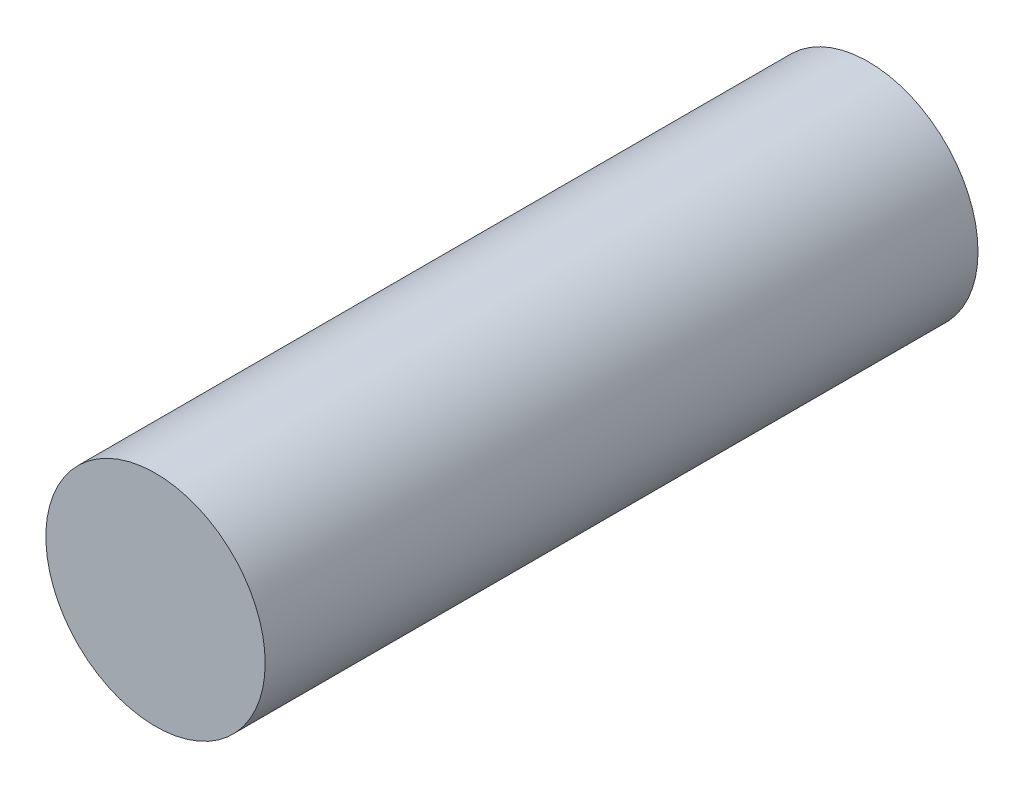
ISO-10303-21;
HEADER;
FILE_DESCRIPTION(('STEP AP214'),'2;1');
FILE_NAME('part.step','',(''),(''),'','','');
FILE_SCHEMA(('AUTOMOTIVE_DESIGN { 1 0 10303 214 1 1 1 1 }'));
ENDSEC;
DATA;
#1=APPLICATION_CONTEXT('core data for automotive mechanical design processes');
#2=APPLICATION_PROTOCOL_DEFINITION('international standard','automotive_design',2000,#1);
#3=PRODUCT_CONTEXT('',#1,'mechanical');
#4=PRODUCT('Part','Part','',(#3));
#5=PRODUCT_RELATED_PRODUCT_CATEGORY('part','',(#4));
#6=PRODUCT_DEFINITION_FORMATION('','',#4);
#7=PRODUCT_DEFINITION_CONTEXT('part definition',#1,'design');
#8=PRODUCT_DEFINITION('design','',#6,#7);
#9=PRODUCT_DEFINITION_SHAPE('','',#8);
#10=(LENGTH_UNIT() NAMED_UNIT(*) SI_UNIT(.MILLI.,.METRE.));
#11=(NAMED_UNIT(*) PLANE_ANGLE_UNIT() SI_UNIT($,.RADIAN.));
#12=(NAMED_UNIT(*) SI_UNIT($,.STERADIAN.) SOLID_ANGLE_UNIT());
#13=UNCERTAINTY_MEASURE_WITH_UNIT(LENGTH_MEASURE(1.E-05),#10,'distance_accuracy_value','');
#14=(GEOMETRIC_REPRESENTATION_CONTEXT(3) GLOBAL_UNCERTAINTY_ASSIGNED_CONTEXT((#13)) GLOBAL_UNIT_ASSIGNED_CONTEXT((#10,
#11,#12)) REPRESENTATION_CONTEXT('',''));
#15=CARTESIAN_POINT('',(0.,0.,0.));
#16=DIRECTION('',(0.,0.,1.));
#17=DIRECTION('',(1.,0.,0.));
#18=AXIS2_PLACEMENT_3D('',#15,#16,#17);
#19=CARTESIAN_POINT('',(0.,0.,13.));
#20=DIRECTION('',(0.,0.,-1.));
#21=DIRECTION('',(-1.,0.,0.));
#22=AXIS2_PLACEMENT_3D('',#19,#20,#21);
#23=CYLINDRICAL_SURFACE('',#22,2.);
#24=CARTESIAN_POINT('',(0.,0.,13.));
#25=DIRECTION('',(0.,0.,1.));
#26=DIRECTION('',(1.,0.,0.));
#27=AXIS2_PLACEMENT_3D('',#24,#25,#26);
#28=CIRCLE('',#27,2.);
#29=CARTESIAN_POINT('',(2.,0.,13.));
#30=VERTEX_POINT('',#29);
#31=EDGE_CURVE('E10',#30,#30,#28,.T.);
#32=ORIENTED_EDGE('',*,*,#31,.F.);
#33=EDGE_LOOP('',(#32));
#34=FACE_BOUND('',#33,.T.);
#35=CARTESIAN_POINT('',(0.,0.,0.));
#36=DIRECTION('',(0.,0.,1.));
#37=DIRECTION('',(1.,0.,0.));
#38=AXIS2_PLACEMENT_3D('',#35,#36,#37);
#39=CIRCLE('',#38,2.);
#40=CARTESIAN_POINT('',(2.,0.,0.));
#41=VERTEX_POINT('',#40);
#42=EDGE_CURVE('E33',#41,#41,#39,.T.);
#43=ORIENTED_EDGE('',*,*,#42,.T.);
#44=EDGE_LOOP('',(#43));
#45=FACE_BOUND('',#44,.T.);
#46=ADVANCED_FACE('F30',(#34,#45),#23,.T.);
#47=CARTESIAN_POINT('',(0.,0.,13.));
#48=DIRECTION('',(0.,0.,1.));
#49=DIRECTION('',(1.,0.,0.));
#50=AXIS2_PLACEMENT_3D('',#47,#48,#49);
#51=PLANE('',#50);
#52=ORIENTED_EDGE('',*,*,#31,.T.);
#53=EDGE_LOOP('',(#52));
#54=FACE_BOUND('',#53,.T.);
#55=ADVANCED_FACE('F45',(#54),#51,.T.);
#56=CARTESIAN_POINT('',(0.,0.,0.));
#57=DIRECTION('',(0.,0.,1.));
#58=DIRECTION('',(1.,0.,0.));
#59=AXIS2_PLACEMENT_3D('',#56,#57,#58);
#60=PLANE('',#59);
#61=ORIENTED_EDGE('',*,*,#42,.F.);
#62=EDGE_LOOP('',(#61));
#63=FACE_BOUND('',#62,.T.);
#64=ADVANCED_FACE('F43',(#63),#60,.F.);
#65=CLOSED_SHELL('',(#46,#55,#64));
#66=MANIFOLD_SOLID_BREP('B2',#65);
#67=ADVANCED_BREP_SHAPE_REPRESENTATION('',(#18,#66),#14);
#68=SHAPE_DEFINITION_REPRESENTATION(#9,#67);
ENDSEC;
END-ISO-10303-21;
